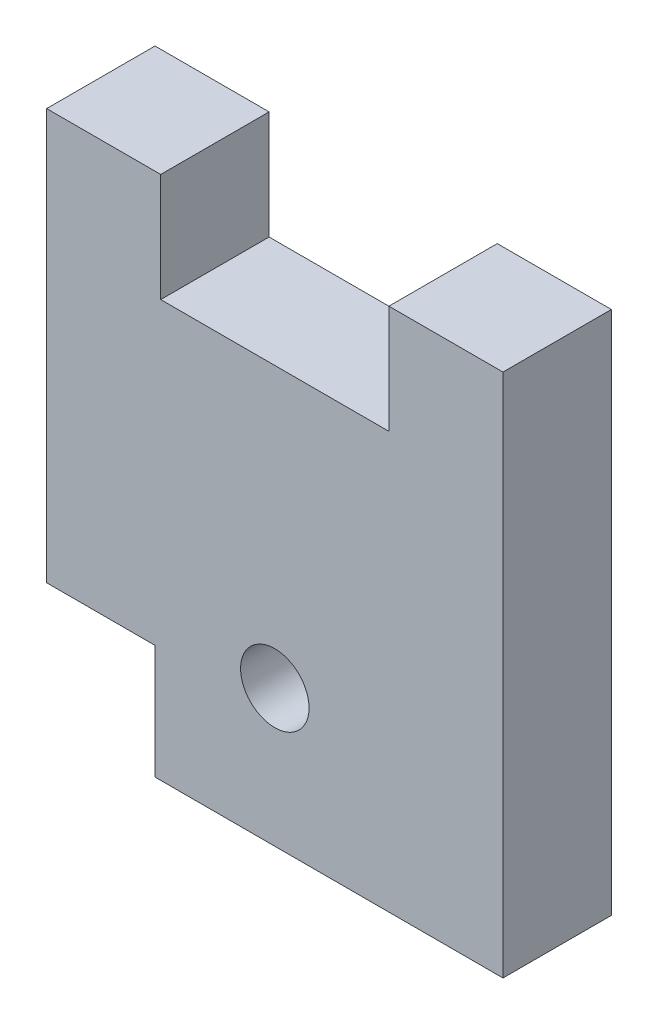
ISO-10303-21;
HEADER;
FILE_DESCRIPTION(('STEP AP214'),'2;1');
FILE_NAME('part.step','',(''),(''),'','','');
FILE_SCHEMA(('AUTOMOTIVE_DESIGN { 1 0 10303 214 1 1 1 1 }'));
ENDSEC;
DATA;
#1=APPLICATION_CONTEXT('core data for automotive mechanical design processes');
#2=APPLICATION_PROTOCOL_DEFINITION('international standard','automotive_design',2000,#1);
#3=PRODUCT_CONTEXT('',#1,'mechanical');
#4=PRODUCT('Part','Part','',(#3));
#5=PRODUCT_RELATED_PRODUCT_CATEGORY('part','',(#4));
#6=PRODUCT_DEFINITION_FORMATION('','',#4);
#7=PRODUCT_DEFINITION_CONTEXT('part definition',#1,'design');
#8=PRODUCT_DEFINITION('design','',#6,#7);
#9=PRODUCT_DEFINITION_SHAPE('','',#8);
#10=(LENGTH_UNIT() NAMED_UNIT(*) SI_UNIT(.MILLI.,.METRE.));
#11=(NAMED_UNIT(*) PLANE_ANGLE_UNIT() SI_UNIT($,.RADIAN.));
#12=(NAMED_UNIT(*) SI_UNIT($,.STERADIAN.) SOLID_ANGLE_UNIT());
#13=UNCERTAINTY_MEASURE_WITH_UNIT(LENGTH_MEASURE(1.E-05),#10,'distance_accuracy_value','');
#14=(GEOMETRIC_REPRESENTATION_CONTEXT(3) GLOBAL_UNCERTAINTY_ASSIGNED_CONTEXT((#13)) GLOBAL_UNIT_ASSIGNED_CONTEXT((#10,
#11,#12)) REPRESENTATION_CONTEXT('',''));
#15=CARTESIAN_POINT('',(0.,0.,0.));
#16=DIRECTION('',(0.,0.,1.));
#17=DIRECTION('',(1.,0.,0.));
#18=AXIS2_PLACEMENT_3D('',#15,#16,#17);
#19=CARTESIAN_POINT('',(0.,0.,4.75));
#20=DIRECTION('',(0.,0.,1.));
#21=DIRECTION('',(1.,0.,0.));
#22=AXIS2_PLACEMENT_3D('',#19,#20,#21);
#23=PLANE('',#22);
#24=DIRECTION('',(0.,-1.,0.));
#25=VECTOR('',#24,1.);
#26=CARTESIAN_POINT('',(0.,0.,4.75));
#27=LINE('',#26,#25);
#28=CARTESIAN_POINT('',(0.,0.,4.75));
#29=VERTEX_POINT('',#28);
#30=CARTESIAN_POINT('',(0.,-18.,4.75));
#31=VERTEX_POINT('',#30);
#32=EDGE_CURVE('E160',#29,#31,#27,.T.);
#33=ORIENTED_EDGE('',*,*,#32,.T.);
#34=DIRECTION('',(1.,0.,0.));
#35=VECTOR('',#34,1.);
#36=CARTESIAN_POINT('',(0.,-18.,4.75));
#37=LINE('',#36,#35);
#38=CARTESIAN_POINT('',(4.75,-18.,4.75));
#39=VERTEX_POINT('',#38);
#40=EDGE_CURVE('E98',#31,#39,#37,.T.);
#41=ORIENTED_EDGE('',*,*,#40,.T.);
#42=DIRECTION('',(0.,-1.,0.));
#43=VECTOR('',#42,1.);
#44=CARTESIAN_POINT('',(4.75,-23.,4.75));
#45=LINE('',#44,#43);
#46=CARTESIAN_POINT('',(4.75,-23.,4.75));
#47=VERTEX_POINT('',#46);
#48=EDGE_CURVE('E181',#39,#47,#45,.T.);
#49=ORIENTED_EDGE('',*,*,#48,.T.);
#50=DIRECTION('',(1.,0.,0.));
#51=VECTOR('',#50,1.);
#52=CARTESIAN_POINT('',(4.75,-23.,4.75));
#53=LINE('',#52,#51);
#54=CARTESIAN_POINT('',(20.,-23.,4.75));
#55=VERTEX_POINT('',#54);
#56=EDGE_CURVE('E200',#47,#55,#53,.T.);
#57=ORIENTED_EDGE('',*,*,#56,.T.);
#58=DIRECTION('',(0.,1.,0.));
#59=VECTOR('',#58,1.);
#60=CARTESIAN_POINT('',(20.,0.,4.75));
#61=LINE('',#60,#59);
#62=CARTESIAN_POINT('',(20.,0.,4.75));
#63=VERTEX_POINT('',#62);
#64=EDGE_CURVE('E197',#55,#63,#61,.T.);
#65=ORIENTED_EDGE('',*,*,#64,.T.);
#66=DIRECTION('',(-1.,0.,0.));
#67=VECTOR('',#66,1.);
#68=CARTESIAN_POINT('',(15.,0.,4.75));
#69=LINE('',#68,#67);
#70=CARTESIAN_POINT('',(15.,0.,4.75));
#71=VERTEX_POINT('',#70);
#72=EDGE_CURVE('E199',#63,#71,#69,.T.);
#73=ORIENTED_EDGE('',*,*,#72,.T.);
#74=DIRECTION('',(0.,-1.,0.));
#75=VECTOR('',#74,1.);
#76=CARTESIAN_POINT('',(15.,0.,4.75));
#77=LINE('',#76,#75);
#78=CARTESIAN_POINT('',(15.,-4.75,4.75));
#79=VERTEX_POINT('',#78);
#80=EDGE_CURVE('E123',#71,#79,#77,.T.);
#81=ORIENTED_EDGE('',*,*,#80,.T.);
#82=DIRECTION('',(-1.,0.,0.));
#83=VECTOR('',#82,1.);
#84=CARTESIAN_POINT('',(5.,-4.75,4.75));
#85=LINE('',#84,#83);
#86=CARTESIAN_POINT('',(5.,-4.75,4.75));
#87=VERTEX_POINT('',#86);
#88=EDGE_CURVE('E117',#79,#87,#85,.T.);
#89=ORIENTED_EDGE('',*,*,#88,.T.);
#90=DIRECTION('',(0.,1.,0.));
#91=VECTOR('',#90,1.);
#92=CARTESIAN_POINT('',(5.,0.,4.75));
#93=LINE('',#92,#91);
#94=CARTESIAN_POINT('',(5.,0.,4.75));
#95=VERTEX_POINT('',#94);
#96=EDGE_CURVE('E121',#87,#95,#93,.T.);
#97=ORIENTED_EDGE('',*,*,#96,.T.);
#98=DIRECTION('',(-1.,0.,0.));
#99=VECTOR('',#98,1.);
#100=CARTESIAN_POINT('',(0.,0.,4.75));
#101=LINE('',#100,#99);
#102=EDGE_CURVE('E49',#95,#29,#101,.T.);
#103=ORIENTED_EDGE('',*,*,#102,.T.);
#104=EDGE_LOOP('',(#33,#41,#49,#57,#65,#73,#81,#89,#97,#103));
#105=FACE_BOUND('',#104,.T.);
#106=CARTESIAN_POINT('',(10.,-17.,4.75));
#107=DIRECTION('',(0.,0.,1.));
#108=DIRECTION('',(1.,0.,0.));
#109=AXIS2_PLACEMENT_3D('',#106,#107,#108);
#110=CIRCLE('',#109,1.5);
#111=CARTESIAN_POINT('',(11.5,-17.,4.75));
#112=VERTEX_POINT('',#111);
#113=EDGE_CURVE('E145',#112,#112,#110,.T.);
#114=ORIENTED_EDGE('',*,*,#113,.F.);
#115=EDGE_LOOP('',(#114));
#116=FACE_BOUND('',#115,.T.);
#117=ADVANCED_FACE('F32',(#105,#116),#23,.T.);
#118=CARTESIAN_POINT('',(0.,0.,0.));
#119=DIRECTION('',(0.,0.,1.));
#120=DIRECTION('',(1.,0.,0.));
#121=AXIS2_PLACEMENT_3D('',#118,#119,#120);
#122=PLANE('',#121);
#123=DIRECTION('',(0.,-1.,0.));
#124=VECTOR('',#123,1.);
#125=CARTESIAN_POINT('',(0.,0.,0.));
#126=LINE('',#125,#124);
#127=CARTESIAN_POINT('',(0.,0.,0.));
#128=VERTEX_POINT('',#127);
#129=CARTESIAN_POINT('',(0.,-18.,0.));
#130=VERTEX_POINT('',#129);
#131=EDGE_CURVE('E141',#128,#130,#126,.T.);
#132=ORIENTED_EDGE('',*,*,#131,.F.);
#133=DIRECTION('',(-1.,0.,0.));
#134=VECTOR('',#133,1.);
#135=CARTESIAN_POINT('',(0.,0.,0.));
#136=LINE('',#135,#134);
#137=CARTESIAN_POINT('',(5.,0.,0.));
#138=VERTEX_POINT('',#137);
#139=EDGE_CURVE('E90',#138,#128,#136,.T.);
#140=ORIENTED_EDGE('',*,*,#139,.F.);
#141=DIRECTION('',(0.,1.,0.));
#142=VECTOR('',#141,1.);
#143=CARTESIAN_POINT('',(5.,0.,0.));
#144=LINE('',#143,#142);
#145=CARTESIAN_POINT('',(5.,-4.75,0.));
#146=VERTEX_POINT('',#145);
#147=EDGE_CURVE('E84',#146,#138,#144,.T.);
#148=ORIENTED_EDGE('',*,*,#147,.F.);
#149=DIRECTION('',(-1.,0.,0.));
#150=VECTOR('',#149,1.);
#151=CARTESIAN_POINT('',(5.,-4.75,0.));
#152=LINE('',#151,#150);
#153=CARTESIAN_POINT('',(15.,-4.75,0.));
#154=VERTEX_POINT('',#153);
#155=EDGE_CURVE('E131',#154,#146,#152,.T.);
#156=ORIENTED_EDGE('',*,*,#155,.F.);
#157=DIRECTION('',(0.,-1.,0.));
#158=VECTOR('',#157,1.);
#159=CARTESIAN_POINT('',(15.,0.,0.));
#160=LINE('',#159,#158);
#161=CARTESIAN_POINT('',(15.,0.,0.));
#162=VERTEX_POINT('',#161);
#163=EDGE_CURVE('E155',#162,#154,#160,.T.);
#164=ORIENTED_EDGE('',*,*,#163,.F.);
#165=DIRECTION('',(-1.,0.,0.));
#166=VECTOR('',#165,1.);
#167=CARTESIAN_POINT('',(15.,0.,0.));
#168=LINE('',#167,#166);
#169=CARTESIAN_POINT('',(20.,0.,0.));
#170=VERTEX_POINT('',#169);
#171=EDGE_CURVE('E153',#170,#162,#168,.T.);
#172=ORIENTED_EDGE('',*,*,#171,.F.);
#173=DIRECTION('',(0.,1.,0.));
#174=VECTOR('',#173,1.);
#175=CARTESIAN_POINT('',(20.,0.,0.));
#176=LINE('',#175,#174);
#177=CARTESIAN_POINT('',(20.,-23.,0.));
#178=VERTEX_POINT('',#177);
#179=EDGE_CURVE('E151',#178,#170,#176,.T.);
#180=ORIENTED_EDGE('',*,*,#179,.F.);
#181=DIRECTION('',(1.,0.,0.));
#182=VECTOR('',#181,1.);
#183=CARTESIAN_POINT('',(4.75,-23.,0.));
#184=LINE('',#183,#182);
#185=CARTESIAN_POINT('',(4.75,-23.,0.));
#186=VERTEX_POINT('',#185);
#187=EDGE_CURVE('E149',#186,#178,#184,.T.);
#188=ORIENTED_EDGE('',*,*,#187,.F.);
#189=DIRECTION('',(0.,-1.,0.));
#190=VECTOR('',#189,1.);
#191=CARTESIAN_POINT('',(4.75,-23.,0.));
#192=LINE('',#191,#190);
#193=CARTESIAN_POINT('',(4.75,-18.,0.));
#194=VERTEX_POINT('',#193);
#195=EDGE_CURVE('E147',#194,#186,#192,.T.);
#196=ORIENTED_EDGE('',*,*,#195,.F.);
#197=DIRECTION('',(1.,0.,0.));
#198=VECTOR('',#197,1.);
#199=CARTESIAN_POINT('',(0.,-18.,0.));
#200=LINE('',#199,#198);
#201=EDGE_CURVE('E144',#130,#194,#200,.T.);
#202=ORIENTED_EDGE('',*,*,#201,.F.);
#203=EDGE_LOOP('',(#132,#140,#148,#156,#164,#172,#180,#188,#196,#202));
#204=FACE_BOUND('',#203,.T.);
#205=CARTESIAN_POINT('',(10.,-17.,0.));
#206=DIRECTION('',(0.,0.,1.));
#207=DIRECTION('',(1.,0.,0.));
#208=AXIS2_PLACEMENT_3D('',#205,#206,#207);
#209=CIRCLE('',#208,1.5);
#210=CARTESIAN_POINT('',(11.5,-17.,0.));
#211=VERTEX_POINT('',#210);
#212=EDGE_CURVE('E208',#211,#211,#209,.T.);
#213=ORIENTED_EDGE('',*,*,#212,.T.);
#214=EDGE_LOOP('',(#213));
#215=FACE_BOUND('',#214,.T.);
#216=ADVANCED_FACE('F185',(#204,#215),#122,.F.);
#217=CARTESIAN_POINT('',(0.,0.,4.75));
#218=DIRECTION('',(1.,0.,0.));
#219=DIRECTION('',(0.,1.,0.));
#220=AXIS2_PLACEMENT_3D('',#217,#218,#219);
#221=PLANE('',#220);
#222=ORIENTED_EDGE('',*,*,#131,.T.);
#223=DIRECTION('',(0.,0.,-1.));
#224=VECTOR('',#223,1.);
#225=CARTESIAN_POINT('',(0.,-18.,4.75));
#226=LINE('',#225,#224);
#227=EDGE_CURVE('E11',#31,#130,#226,.T.);
#228=ORIENTED_EDGE('',*,*,#227,.F.);
#229=ORIENTED_EDGE('',*,*,#32,.F.);
#230=DIRECTION('',(0.,0.,-1.));
#231=VECTOR('',#230,1.);
#232=CARTESIAN_POINT('',(0.,0.,4.75));
#233=LINE('',#232,#231);
#234=EDGE_CURVE('E137',#29,#128,#233,.T.);
#235=ORIENTED_EDGE('',*,*,#234,.T.);
#236=EDGE_LOOP('',(#222,#228,#229,#235));
#237=FACE_BOUND('',#236,.T.);
#238=ADVANCED_FACE('F34',(#237),#221,.F.);
#239=CARTESIAN_POINT('',(0.,-18.,4.75));
#240=DIRECTION('',(0.,1.,0.));
#241=DIRECTION('',(-1.,0.,0.));
#242=AXIS2_PLACEMENT_3D('',#239,#240,#241);
#243=PLANE('',#242);
#244=ORIENTED_EDGE('',*,*,#201,.T.);
#245=DIRECTION('',(0.,0.,-1.));
#246=VECTOR('',#245,1.);
#247=CARTESIAN_POINT('',(4.75,-18.,4.75));
#248=LINE('',#247,#246);
#249=EDGE_CURVE('E41',#39,#194,#248,.T.);
#250=ORIENTED_EDGE('',*,*,#249,.F.);
#251=ORIENTED_EDGE('',*,*,#40,.F.);
#252=ORIENTED_EDGE('',*,*,#227,.T.);
#253=EDGE_LOOP('',(#244,#250,#251,#252));
#254=FACE_BOUND('',#253,.T.);
#255=ADVANCED_FACE('F244',(#254),#243,.F.);
#256=CARTESIAN_POINT('',(4.75,-23.,4.75));
#257=DIRECTION('',(1.,0.,0.));
#258=DIRECTION('',(0.,1.,0.));
#259=AXIS2_PLACEMENT_3D('',#256,#257,#258);
#260=PLANE('',#259);
#261=ORIENTED_EDGE('',*,*,#195,.T.);
#262=DIRECTION('',(0.,0.,-1.));
#263=VECTOR('',#262,1.);
#264=CARTESIAN_POINT('',(4.75,-23.,4.75));
#265=LINE('',#264,#263);
#266=EDGE_CURVE('E173',#47,#186,#265,.T.);
#267=ORIENTED_EDGE('',*,*,#266,.F.);
#268=ORIENTED_EDGE('',*,*,#48,.F.);
#269=ORIENTED_EDGE('',*,*,#249,.T.);
#270=EDGE_LOOP('',(#261,#267,#268,#269));
#271=FACE_BOUND('',#270,.T.);
#272=ADVANCED_FACE('F179',(#271),#260,.F.);
#273=CARTESIAN_POINT('',(4.75,-23.,4.75));
#274=DIRECTION('',(0.,1.,0.));
#275=DIRECTION('',(0.,0.,1.));
#276=AXIS2_PLACEMENT_3D('',#273,#274,#275);
#277=PLANE('',#276);
#278=ORIENTED_EDGE('',*,*,#187,.T.);
#279=DIRECTION('',(0.,0.,-1.));
#280=VECTOR('',#279,1.);
#281=CARTESIAN_POINT('',(20.,-23.,4.75));
#282=LINE('',#281,#280);
#283=EDGE_CURVE('E170',#55,#178,#282,.T.);
#284=ORIENTED_EDGE('',*,*,#283,.F.);
#285=ORIENTED_EDGE('',*,*,#56,.F.);
#286=ORIENTED_EDGE('',*,*,#266,.T.);
#287=EDGE_LOOP('',(#278,#284,#285,#286));
#288=FACE_BOUND('',#287,.T.);
#289=ADVANCED_FACE('F191',(#288),#277,.F.);
#290=CARTESIAN_POINT('',(20.,0.,4.75));
#291=DIRECTION('',(-1.,0.,0.));
#292=DIRECTION('',(0.,-1.,0.));
#293=AXIS2_PLACEMENT_3D('',#290,#291,#292);
#294=PLANE('',#293);
#295=ORIENTED_EDGE('',*,*,#179,.T.);
#296=DIRECTION('',(0.,0.,-1.));
#297=VECTOR('',#296,1.);
#298=CARTESIAN_POINT('',(20.,0.,4.75));
#299=LINE('',#298,#297);
#300=EDGE_CURVE('E167',#63,#170,#299,.T.);
#301=ORIENTED_EDGE('',*,*,#300,.F.);
#302=ORIENTED_EDGE('',*,*,#64,.F.);
#303=ORIENTED_EDGE('',*,*,#283,.T.);
#304=EDGE_LOOP('',(#295,#301,#302,#303));
#305=FACE_BOUND('',#304,.T.);
#306=ADVANCED_FACE('F195',(#305),#294,.F.);
#307=CARTESIAN_POINT('',(15.,0.,4.75));
#308=DIRECTION('',(0.,-1.,0.));
#309=DIRECTION('',(0.,0.,-1.));
#310=AXIS2_PLACEMENT_3D('',#307,#308,#309);
#311=PLANE('',#310);
#312=ORIENTED_EDGE('',*,*,#171,.T.);
#313=DIRECTION('',(0.,0.,-1.));
#314=VECTOR('',#313,1.);
#315=CARTESIAN_POINT('',(15.,0.,4.75));
#316=LINE('',#315,#314);
#317=EDGE_CURVE('E164',#71,#162,#316,.T.);
#318=ORIENTED_EDGE('',*,*,#317,.F.);
#319=ORIENTED_EDGE('',*,*,#72,.F.);
#320=ORIENTED_EDGE('',*,*,#300,.T.);
#321=EDGE_LOOP('',(#312,#318,#319,#320));
#322=FACE_BOUND('',#321,.T.);
#323=ADVANCED_FACE('F234',(#322),#311,.F.);
#324=CARTESIAN_POINT('',(15.,0.,4.75));
#325=DIRECTION('',(1.,0.,0.));
#326=DIRECTION('',(0.,1.,0.));
#327=AXIS2_PLACEMENT_3D('',#324,#325,#326);
#328=PLANE('',#327);
#329=ORIENTED_EDGE('',*,*,#163,.T.);
#330=DIRECTION('',(0.,0.,-1.));
#331=VECTOR('',#330,1.);
#332=CARTESIAN_POINT('',(15.,-4.75,4.75));
#333=LINE('',#332,#331);
#334=EDGE_CURVE('E132',#79,#154,#333,.T.);
#335=ORIENTED_EDGE('',*,*,#334,.F.);
#336=ORIENTED_EDGE('',*,*,#80,.F.);
#337=ORIENTED_EDGE('',*,*,#317,.T.);
#338=EDGE_LOOP('',(#329,#335,#336,#337));
#339=FACE_BOUND('',#338,.T.);
#340=ADVANCED_FACE('F231',(#339),#328,.F.);
#341=CARTESIAN_POINT('',(5.,-4.75,4.75));
#342=DIRECTION('',(0.,-1.,0.));
#343=DIRECTION('',(0.,0.,-1.));
#344=AXIS2_PLACEMENT_3D('',#341,#342,#343);
#345=PLANE('',#344);
#346=ORIENTED_EDGE('',*,*,#155,.T.);
#347=DIRECTION('',(0.,0.,-1.));
#348=VECTOR('',#347,1.);
#349=CARTESIAN_POINT('',(5.,-4.75,4.75));
#350=LINE('',#349,#348);
#351=EDGE_CURVE('E128',#87,#146,#350,.T.);
#352=ORIENTED_EDGE('',*,*,#351,.F.);
#353=ORIENTED_EDGE('',*,*,#88,.F.);
#354=ORIENTED_EDGE('',*,*,#334,.T.);
#355=EDGE_LOOP('',(#346,#352,#353,#354));
#356=FACE_BOUND('',#355,.T.);
#357=ADVANCED_FACE('F129',(#356),#345,.F.);
#358=CARTESIAN_POINT('',(5.,0.,4.75));
#359=DIRECTION('',(-1.,0.,0.));
#360=DIRECTION('',(0.,-1.,0.));
#361=AXIS2_PLACEMENT_3D('',#358,#359,#360);
#362=PLANE('',#361);
#363=ORIENTED_EDGE('',*,*,#147,.T.);
#364=DIRECTION('',(0.,0.,-1.));
#365=VECTOR('',#364,1.);
#366=CARTESIAN_POINT('',(5.,0.,4.75));
#367=LINE('',#366,#365);
#368=EDGE_CURVE('E133',#95,#138,#367,.T.);
#369=ORIENTED_EDGE('',*,*,#368,.F.);
#370=ORIENTED_EDGE('',*,*,#96,.F.);
#371=ORIENTED_EDGE('',*,*,#351,.T.);
#372=EDGE_LOOP('',(#363,#369,#370,#371));
#373=FACE_BOUND('',#372,.T.);
#374=ADVANCED_FACE('F135',(#373),#362,.F.);
#375=CARTESIAN_POINT('',(0.,0.,4.75));
#376=DIRECTION('',(0.,-1.,0.));
#377=DIRECTION('',(0.,0.,-1.));
#378=AXIS2_PLACEMENT_3D('',#375,#376,#377);
#379=PLANE('',#378);
#380=ORIENTED_EDGE('',*,*,#139,.T.);
#381=ORIENTED_EDGE('',*,*,#234,.F.);
#382=ORIENTED_EDGE('',*,*,#102,.F.);
#383=ORIENTED_EDGE('',*,*,#368,.T.);
#384=EDGE_LOOP('',(#380,#381,#382,#383));
#385=FACE_BOUND('',#384,.T.);
#386=ADVANCED_FACE('F224',(#385),#379,.F.);
#387=CARTESIAN_POINT('',(10.,-17.,4.75));
#388=DIRECTION('',(0.,0.,-1.));
#389=DIRECTION('',(-1.,0.,0.));
#390=AXIS2_PLACEMENT_3D('',#387,#388,#389);
#391=CYLINDRICAL_SURFACE('',#390,1.5);
#392=ORIENTED_EDGE('',*,*,#113,.T.);
#393=EDGE_LOOP('',(#392));
#394=FACE_BOUND('',#393,.T.);
#395=ORIENTED_EDGE('',*,*,#212,.F.);
#396=EDGE_LOOP('',(#395));
#397=FACE_BOUND('',#396,.T.);
#398=ADVANCED_FACE('F214',(#394,#397),#391,.F.);
#399=CLOSED_SHELL('',(#117,#216,#238,#255,#272,#289,#306,#323,#340,#357,#374,#386,#398));
#400=MANIFOLD_SOLID_BREP('B2',#399);
#401=ADVANCED_BREP_SHAPE_REPRESENTATION('',(#18,#400),#14);
#402=SHAPE_DEFINITION_REPRESENTATION(#9,#401);
ENDSEC;
END-ISO-10303-21;
